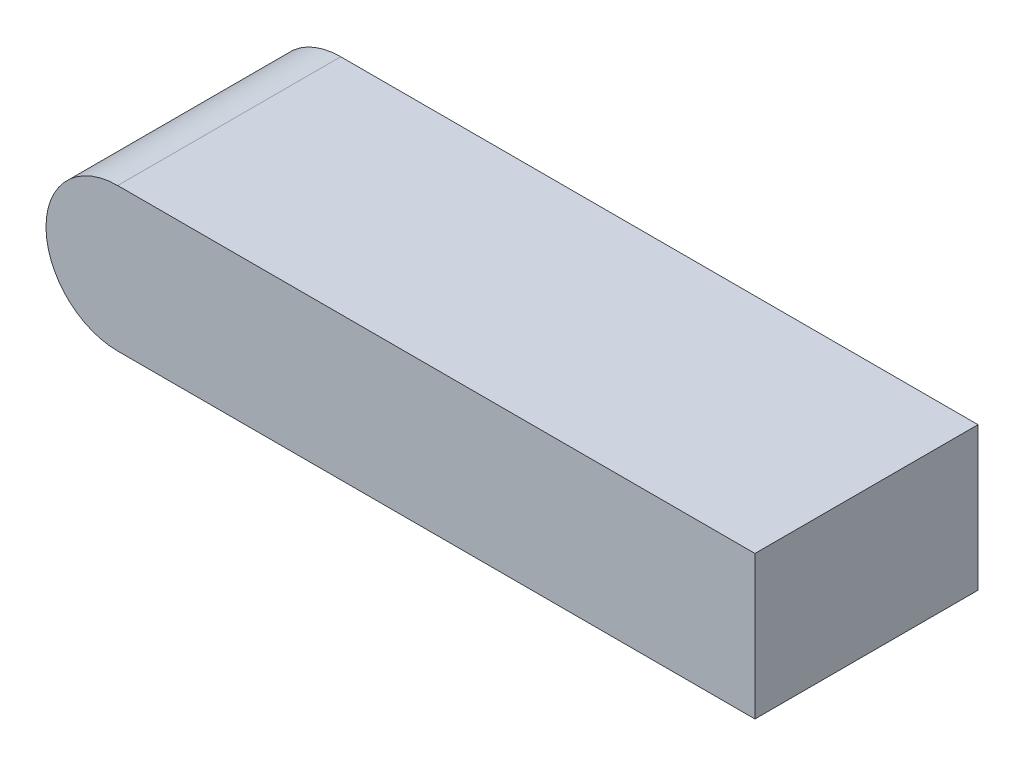
ISO-10303-21;
HEADER;
FILE_DESCRIPTION(('STEP AP214'),'2;1');
FILE_NAME('part.step','',(''),(''),'','','');
FILE_SCHEMA(('AUTOMOTIVE_DESIGN { 1 0 10303 214 1 1 1 1 }'));
ENDSEC;
DATA;
#1=APPLICATION_CONTEXT('core data for automotive mechanical design processes');
#2=APPLICATION_PROTOCOL_DEFINITION('international standard','automotive_design',2000,#1);
#3=PRODUCT_CONTEXT('',#1,'mechanical');
#4=PRODUCT('Part','Part','',(#3));
#5=PRODUCT_RELATED_PRODUCT_CATEGORY('part','',(#4));
#6=PRODUCT_DEFINITION_FORMATION('','',#4);
#7=PRODUCT_DEFINITION_CONTEXT('part definition',#1,'design');
#8=PRODUCT_DEFINITION('design','',#6,#7);
#9=PRODUCT_DEFINITION_SHAPE('','',#8);
#10=(LENGTH_UNIT() NAMED_UNIT(*) SI_UNIT(.MILLI.,.METRE.));
#11=(NAMED_UNIT(*) PLANE_ANGLE_UNIT() SI_UNIT($,.RADIAN.));
#12=(NAMED_UNIT(*) SI_UNIT($,.STERADIAN.) SOLID_ANGLE_UNIT());
#13=UNCERTAINTY_MEASURE_WITH_UNIT(LENGTH_MEASURE(1.E-05),#10,'distance_accuracy_value','');
#14=(GEOMETRIC_REPRESENTATION_CONTEXT(3) GLOBAL_UNCERTAINTY_ASSIGNED_CONTEXT((#13)) GLOBAL_UNIT_ASSIGNED_CONTEXT((#10,
#11,#12)) REPRESENTATION_CONTEXT('',''));
#15=CARTESIAN_POINT('',(0.,0.,0.));
#16=DIRECTION('',(0.,0.,1.));
#17=DIRECTION('',(1.,0.,0.));
#18=AXIS2_PLACEMENT_3D('',#15,#16,#17);
#19=CARTESIAN_POINT('',(63.5,14.2875,22.225));
#20=DIRECTION('',(-1.,0.,0.));
#21=DIRECTION('',(0.,0.,1.));
#22=AXIS2_PLACEMENT_3D('',#19,#20,#21);
#23=PLANE('',#22);
#24=DIRECTION('',(0.,0.,-1.));
#25=VECTOR('',#24,1.);
#26=CARTESIAN_POINT('',(63.5,-14.2875,22.225));
#27=LINE('',#26,#25);
#28=CARTESIAN_POINT('',(63.5,-14.2875,22.225));
#29=VERTEX_POINT('',#28);
#30=CARTESIAN_POINT('',(63.5,-14.2875,-22.225));
#31=VERTEX_POINT('',#30);
#32=EDGE_CURVE('E84',#29,#31,#27,.T.);
#33=ORIENTED_EDGE('',*,*,#32,.T.);
#34=DIRECTION('',(0.,-1.,0.));
#35=VECTOR('',#34,1.);
#36=CARTESIAN_POINT('',(63.5,14.2875,-22.225));
#37=LINE('',#36,#35);
#38=CARTESIAN_POINT('',(63.5,14.2875,-22.225));
#39=VERTEX_POINT('',#38);
#40=EDGE_CURVE('E11',#39,#31,#37,.T.);
#41=ORIENTED_EDGE('',*,*,#40,.F.);
#42=DIRECTION('',(0.,0.,-1.));
#43=VECTOR('',#42,1.);
#44=CARTESIAN_POINT('',(63.5,14.2875,22.225));
#45=LINE('',#44,#43);
#46=CARTESIAN_POINT('',(63.5,14.2875,22.225));
#47=VERTEX_POINT('',#46);
#48=EDGE_CURVE('E85',#47,#39,#45,.T.);
#49=ORIENTED_EDGE('',*,*,#48,.F.);
#50=DIRECTION('',(0.,-1.,0.));
#51=VECTOR('',#50,1.);
#52=CARTESIAN_POINT('',(63.5,14.2875,22.225));
#53=LINE('',#52,#51);
#54=EDGE_CURVE('E42',#47,#29,#53,.T.);
#55=ORIENTED_EDGE('',*,*,#54,.T.);
#56=EDGE_LOOP('',(#33,#41,#49,#55));
#57=FACE_BOUND('',#56,.T.);
#58=ADVANCED_FACE('F34',(#57),#23,.F.);
#59=CARTESIAN_POINT('',(-63.5,14.2875,-22.225));
#60=DIRECTION('',(0.,0.,1.));
#61=DIRECTION('',(1.,0.,0.));
#62=AXIS2_PLACEMENT_3D('',#59,#60,#61);
#63=PLANE('',#62);
#64=DIRECTION('',(-1.,0.,0.));
#65=VECTOR('',#64,1.);
#66=CARTESIAN_POINT('',(-63.5,-14.2875,-22.225));
#67=LINE('',#66,#65);
#68=CARTESIAN_POINT('',(-63.5,-14.2875,-22.225));
#69=VERTEX_POINT('',#68);
#70=EDGE_CURVE('E63',#31,#69,#67,.T.);
#71=ORIENTED_EDGE('',*,*,#70,.T.);
#72=CARTESIAN_POINT('',(-63.5,0.,-22.225));
#73=DIRECTION('',(0.,0.,-1.));
#74=DIRECTION('',(1.,0.,0.));
#75=AXIS2_PLACEMENT_3D('',#72,#73,#74);
#76=CIRCLE('',#75,14.2875);
#77=CARTESIAN_POINT('',(-63.5,14.2875,-22.225));
#78=VERTEX_POINT('',#77);
#79=EDGE_CURVE('E92',#69,#78,#76,.T.);
#80=ORIENTED_EDGE('',*,*,#79,.T.);
#81=DIRECTION('',(-1.,0.,0.));
#82=VECTOR('',#81,1.);
#83=CARTESIAN_POINT('',(-63.5,14.2875,-22.225));
#84=LINE('',#83,#82);
#85=EDGE_CURVE('E75',#39,#78,#84,.T.);
#86=ORIENTED_EDGE('',*,*,#85,.F.);
#87=ORIENTED_EDGE('',*,*,#40,.T.);
#88=EDGE_LOOP('',(#71,#80,#86,#87));
#89=FACE_BOUND('',#88,.T.);
#90=ADVANCED_FACE('F105',(#89),#63,.F.);
#91=CARTESIAN_POINT('',(-63.5,14.2875,22.225));
#92=DIRECTION('',(0.,0.,-1.));
#93=DIRECTION('',(-1.,0.,0.));
#94=AXIS2_PLACEMENT_3D('',#91,#92,#93);
#95=PLANE('',#94);
#96=DIRECTION('',(1.,0.,0.));
#97=VECTOR('',#96,1.);
#98=CARTESIAN_POINT('',(-63.5,-14.2875,22.225));
#99=LINE('',#98,#97);
#100=CARTESIAN_POINT('',(-63.5,-14.2875,22.225));
#101=VERTEX_POINT('',#100);
#102=EDGE_CURVE('E70',#101,#29,#99,.T.);
#103=ORIENTED_EDGE('',*,*,#102,.T.);
#104=ORIENTED_EDGE('',*,*,#54,.F.);
#105=DIRECTION('',(1.,0.,0.));
#106=VECTOR('',#105,1.);
#107=CARTESIAN_POINT('',(-63.5,14.2875,22.225));
#108=LINE('',#107,#106);
#109=CARTESIAN_POINT('',(-63.5,14.2875,22.225));
#110=VERTEX_POINT('',#109);
#111=EDGE_CURVE('E50',#110,#47,#108,.T.);
#112=ORIENTED_EDGE('',*,*,#111,.F.);
#113=CARTESIAN_POINT('',(-63.5,0.,22.225));
#114=DIRECTION('',(0.,0.,-1.));
#115=DIRECTION('',(-1.,0.,0.));
#116=AXIS2_PLACEMENT_3D('',#113,#114,#115);
#117=CIRCLE('',#116,14.2875);
#118=EDGE_CURVE('E88',#110,#101,#117,.F.);
#119=ORIENTED_EDGE('',*,*,#118,.T.);
#120=EDGE_LOOP('',(#103,#104,#112,#119));
#121=FACE_BOUND('',#120,.T.);
#122=ADVANCED_FACE('F89',(#121),#95,.F.);
#123=CARTESIAN_POINT('',(0.,14.2875,0.));
#124=DIRECTION('',(0.,-1.,0.));
#125=DIRECTION('',(0.,0.,-1.));
#126=AXIS2_PLACEMENT_3D('',#123,#124,#125);
#127=PLANE('',#126);
#128=ORIENTED_EDGE('',*,*,#48,.T.);
#129=ORIENTED_EDGE('',*,*,#85,.T.);
#130=DIRECTION('',(0.,0.,1.));
#131=VECTOR('',#130,1.);
#132=CARTESIAN_POINT('',(-63.5,14.2875,22.225));
#133=LINE('',#132,#131);
#134=EDGE_CURVE('E100',#78,#110,#133,.T.);
#135=ORIENTED_EDGE('',*,*,#134,.T.);
#136=ORIENTED_EDGE('',*,*,#111,.T.);
#137=EDGE_LOOP('',(#128,#129,#135,#136));
#138=FACE_BOUND('',#137,.T.);
#139=ADVANCED_FACE('F111',(#138),#127,.F.);
#140=CARTESIAN_POINT('',(0.,-14.2875,0.));
#141=DIRECTION('',(0.,-1.,0.));
#142=DIRECTION('',(0.,0.,-1.));
#143=AXIS2_PLACEMENT_3D('',#140,#141,#142);
#144=PLANE('',#143);
#145=ORIENTED_EDGE('',*,*,#32,.F.);
#146=ORIENTED_EDGE('',*,*,#102,.F.);
#147=DIRECTION('',(0.,0.,1.));
#148=VECTOR('',#147,1.);
#149=CARTESIAN_POINT('',(-63.5,-14.2875,22.225));
#150=LINE('',#149,#148);
#151=EDGE_CURVE('E81',#69,#101,#150,.T.);
#152=ORIENTED_EDGE('',*,*,#151,.F.);
#153=ORIENTED_EDGE('',*,*,#70,.F.);
#154=EDGE_LOOP('',(#145,#146,#152,#153));
#155=FACE_BOUND('',#154,.T.);
#156=ADVANCED_FACE('F79',(#155),#144,.T.);
#157=CARTESIAN_POINT('',(-63.5,0.,54.1728212285282));
#158=DIRECTION('',(0.,0.,-1.));
#159=DIRECTION('',(-1.,0.,0.));
#160=AXIS2_PLACEMENT_3D('',#157,#158,#159);
#161=CYLINDRICAL_SURFACE('',#160,14.2875);
#162=ORIENTED_EDGE('',*,*,#118,.F.);
#163=ORIENTED_EDGE('',*,*,#134,.F.);
#164=ORIENTED_EDGE('',*,*,#79,.F.);
#165=ORIENTED_EDGE('',*,*,#151,.T.);
#166=EDGE_LOOP('',(#162,#163,#164,#165));
#167=FACE_BOUND('',#166,.T.);
#168=ADVANCED_FACE('F94',(#167),#161,.T.);
#169=CLOSED_SHELL('',(#58,#90,#122,#139,#156,#168));
#170=MANIFOLD_SOLID_BREP('B2',#169);
#171=ADVANCED_BREP_SHAPE_REPRESENTATION('',(#18,#170),#14);
#172=SHAPE_DEFINITION_REPRESENTATION(#9,#171);
ENDSEC;
END-ISO-10303-21;
